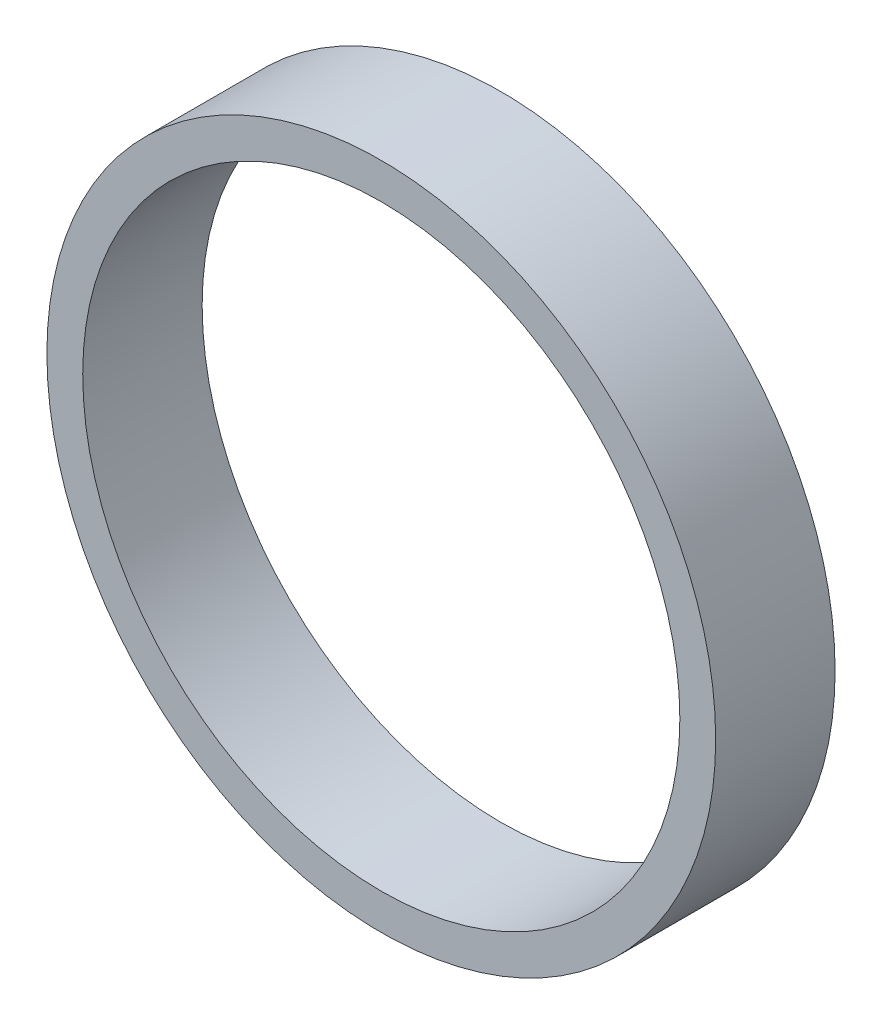
ISO-10303-21;
HEADER;
FILE_DESCRIPTION(('STEP AP214'),'2;1');
FILE_NAME('part.step','',(''),(''),'','','');
FILE_SCHEMA(('AUTOMOTIVE_DESIGN { 1 0 10303 214 1 1 1 1 }'));
ENDSEC;
DATA;
#1=APPLICATION_CONTEXT('core data for automotive mechanical design processes');
#2=APPLICATION_PROTOCOL_DEFINITION('international standard','automotive_design',2000,#1);
#3=PRODUCT_CONTEXT('',#1,'mechanical');
#4=PRODUCT('Part','Part','',(#3));
#5=PRODUCT_RELATED_PRODUCT_CATEGORY('part','',(#4));
#6=PRODUCT_DEFINITION_FORMATION('','',#4);
#7=PRODUCT_DEFINITION_CONTEXT('part definition',#1,'design');
#8=PRODUCT_DEFINITION('design','',#6,#7);
#9=PRODUCT_DEFINITION_SHAPE('','',#8);
#10=(LENGTH_UNIT() NAMED_UNIT(*) SI_UNIT(.MILLI.,.METRE.));
#11=(NAMED_UNIT(*) PLANE_ANGLE_UNIT() SI_UNIT($,.RADIAN.));
#12=(NAMED_UNIT(*) SI_UNIT($,.STERADIAN.) SOLID_ANGLE_UNIT());
#13=UNCERTAINTY_MEASURE_WITH_UNIT(LENGTH_MEASURE(1.E-05),#10,'distance_accuracy_value','');
#14=(GEOMETRIC_REPRESENTATION_CONTEXT(3) GLOBAL_UNCERTAINTY_ASSIGNED_CONTEXT((#13)) GLOBAL_UNIT_ASSIGNED_CONTEXT((#10,
#11,#12)) REPRESENTATION_CONTEXT('',''));
#15=CARTESIAN_POINT('',(0.,0.,0.));
#16=DIRECTION('',(0.,0.,1.));
#17=DIRECTION('',(1.,0.,0.));
#18=AXIS2_PLACEMENT_3D('',#15,#16,#17);
#19=CARTESIAN_POINT('',(0.,0.,5.));
#20=DIRECTION('',(0.,0.,1.));
#21=DIRECTION('',(1.,0.,0.));
#22=AXIS2_PLACEMENT_3D('',#19,#20,#21);
#23=PLANE('',#22);
#24=CARTESIAN_POINT('',(0.,0.,5.));
#25=DIRECTION('',(0.,0.,1.));
#26=DIRECTION('',(1.,0.,0.));
#27=AXIS2_PLACEMENT_3D('',#24,#25,#26);
#28=CIRCLE('',#27,14.);
#29=CARTESIAN_POINT('',(14.,0.,5.));
#30=VERTEX_POINT('',#29);
#31=EDGE_CURVE('E10',#30,#30,#28,.T.);
#32=ORIENTED_EDGE('',*,*,#31,.T.);
#33=EDGE_LOOP('',(#32));
#34=FACE_BOUND('',#33,.T.);
#35=CARTESIAN_POINT('',(0.,0.,5.));
#36=DIRECTION('',(0.,0.,1.));
#37=DIRECTION('',(1.,0.,0.));
#38=AXIS2_PLACEMENT_3D('',#35,#36,#37);
#39=CIRCLE('',#38,12.5);
#40=CARTESIAN_POINT('',(12.5,0.,5.));
#41=VERTEX_POINT('',#40);
#42=EDGE_CURVE('E51',#41,#41,#39,.T.);
#43=ORIENTED_EDGE('',*,*,#42,.F.);
#44=EDGE_LOOP('',(#43));
#45=FACE_BOUND('',#44,.T.);
#46=ADVANCED_FACE('F38',(#34,#45),#23,.T.);
#47=CARTESIAN_POINT('',(0.,0.,0.));
#48=DIRECTION('',(0.,0.,1.));
#49=DIRECTION('',(1.,0.,0.));
#50=AXIS2_PLACEMENT_3D('',#47,#48,#49);
#51=PLANE('',#50);
#52=CARTESIAN_POINT('',(0.,0.,0.));
#53=DIRECTION('',(0.,0.,1.));
#54=DIRECTION('',(1.,0.,0.));
#55=AXIS2_PLACEMENT_3D('',#52,#53,#54);
#56=CIRCLE('',#55,14.);
#57=CARTESIAN_POINT('',(14.,0.,0.));
#58=VERTEX_POINT('',#57);
#59=EDGE_CURVE('E42',#58,#58,#56,.T.);
#60=ORIENTED_EDGE('',*,*,#59,.F.);
#61=EDGE_LOOP('',(#60));
#62=FACE_BOUND('',#61,.T.);
#63=CARTESIAN_POINT('',(0.,0.,0.));
#64=DIRECTION('',(0.,0.,1.));
#65=DIRECTION('',(1.,0.,0.));
#66=AXIS2_PLACEMENT_3D('',#63,#64,#65);
#67=CIRCLE('',#66,12.5);
#68=CARTESIAN_POINT('',(12.5,0.,0.));
#69=VERTEX_POINT('',#68);
#70=EDGE_CURVE('E53',#69,#69,#67,.T.);
#71=ORIENTED_EDGE('',*,*,#70,.T.);
#72=EDGE_LOOP('',(#71));
#73=FACE_BOUND('',#72,.T.);
#74=ADVANCED_FACE('F65',(#62,#73),#51,.F.);
#75=CARTESIAN_POINT('',(0.,0.,5.));
#76=DIRECTION('',(0.,0.,-1.));
#77=DIRECTION('',(-1.,0.,0.));
#78=AXIS2_PLACEMENT_3D('',#75,#76,#77);
#79=CYLINDRICAL_SURFACE('',#78,14.);
#80=ORIENTED_EDGE('',*,*,#31,.F.);
#81=EDGE_LOOP('',(#80));
#82=FACE_BOUND('',#81,.T.);
#83=ORIENTED_EDGE('',*,*,#59,.T.);
#84=EDGE_LOOP('',(#83));
#85=FACE_BOUND('',#84,.T.);
#86=ADVANCED_FACE('F40',(#82,#85),#79,.T.);
#87=CARTESIAN_POINT('',(0.,0.,5.));
#88=DIRECTION('',(0.,0.,-1.));
#89=DIRECTION('',(-1.,0.,0.));
#90=AXIS2_PLACEMENT_3D('',#87,#88,#89);
#91=CYLINDRICAL_SURFACE('',#90,12.5);
#92=ORIENTED_EDGE('',*,*,#42,.T.);
#93=EDGE_LOOP('',(#92));
#94=FACE_BOUND('',#93,.T.);
#95=ORIENTED_EDGE('',*,*,#70,.F.);
#96=EDGE_LOOP('',(#95));
#97=FACE_BOUND('',#96,.T.);
#98=ADVANCED_FACE('F61',(#94,#97),#91,.F.);
#99=CLOSED_SHELL('',(#46,#74,#86,#98));
#100=MANIFOLD_SOLID_BREP('B2',#99);
#101=ADVANCED_BREP_SHAPE_REPRESENTATION('',(#18,#100),#14);
#102=SHAPE_DEFINITION_REPRESENTATION(#9,#101);
ENDSEC;
END-ISO-10303-21;
